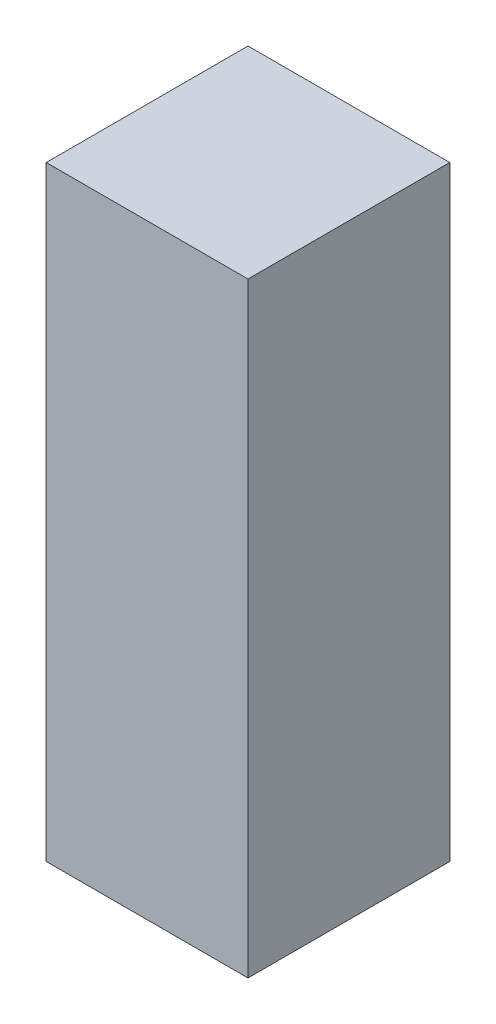
ISO-10303-21;
HEADER;
FILE_DESCRIPTION(('STEP AP214'),'2;1');
FILE_NAME('part.step','',(''),(''),'','','');
FILE_SCHEMA(('AUTOMOTIVE_DESIGN { 1 0 10303 214 1 1 1 1 }'));
ENDSEC;
DATA;
#1=APPLICATION_CONTEXT('core data for automotive mechanical design processes');
#2=APPLICATION_PROTOCOL_DEFINITION('international standard','automotive_design',2000,#1);
#3=PRODUCT_CONTEXT('',#1,'mechanical');
#4=PRODUCT('Part','Part','',(#3));
#5=PRODUCT_RELATED_PRODUCT_CATEGORY('part','',(#4));
#6=PRODUCT_DEFINITION_FORMATION('','',#4);
#7=PRODUCT_DEFINITION_CONTEXT('part definition',#1,'design');
#8=PRODUCT_DEFINITION('design','',#6,#7);
#9=PRODUCT_DEFINITION_SHAPE('','',#8);
#10=(LENGTH_UNIT() NAMED_UNIT(*) SI_UNIT(.MILLI.,.METRE.));
#11=(NAMED_UNIT(*) PLANE_ANGLE_UNIT() SI_UNIT($,.RADIAN.));
#12=(NAMED_UNIT(*) SI_UNIT($,.STERADIAN.) SOLID_ANGLE_UNIT());
#13=UNCERTAINTY_MEASURE_WITH_UNIT(LENGTH_MEASURE(1.E-05),#10,'distance_accuracy_value','');
#14=(GEOMETRIC_REPRESENTATION_CONTEXT(3) GLOBAL_UNCERTAINTY_ASSIGNED_CONTEXT((#13)) GLOBAL_UNIT_ASSIGNED_CONTEXT((#10,
#11,#12)) REPRESENTATION_CONTEXT('',''));
#15=CARTESIAN_POINT('',(0.,0.,0.));
#16=DIRECTION('',(0.,0.,1.));
#17=DIRECTION('',(1.,0.,0.));
#18=AXIS2_PLACEMENT_3D('',#15,#16,#17);
#19=CARTESIAN_POINT('',(-52.7986929138008,150.,-32.2514183315828));
#20=DIRECTION('',(1.,0.,0.));
#21=DIRECTION('',(0.,0.,-1.));
#22=AXIS2_PLACEMENT_3D('',#19,#20,#21);
#23=PLANE('',#22);
#24=DIRECTION('',(0.,0.,1.));
#25=VECTOR('',#24,1.);
#26=CARTESIAN_POINT('',(-52.7986929138008,0.,-32.2514183315828));
#27=LINE('',#26,#25);
#28=CARTESIAN_POINT('',(-52.7986929138008,0.,-32.2514183315828));
#29=VERTEX_POINT('',#28);
#30=CARTESIAN_POINT('',(-52.7986929138008,0.,17.7485816684172));
#31=VERTEX_POINT('',#30);
#32=EDGE_CURVE('E96',#29,#31,#27,.T.);
#33=ORIENTED_EDGE('',*,*,#32,.T.);
#34=DIRECTION('',(0.,-1.,0.));
#35=VECTOR('',#34,1.);
#36=CARTESIAN_POINT('',(-52.7986929138008,150.,17.7485816684172));
#37=LINE('',#36,#35);
#38=CARTESIAN_POINT('',(-52.7986929138008,150.,17.7485816684172));
#39=VERTEX_POINT('',#38);
#40=EDGE_CURVE('E11',#39,#31,#37,.T.);
#41=ORIENTED_EDGE('',*,*,#40,.F.);
#42=DIRECTION('',(0.,0.,1.));
#43=VECTOR('',#42,1.);
#44=CARTESIAN_POINT('',(-52.7986929138008,150.,-32.2514183315828));
#45=LINE('',#44,#43);
#46=CARTESIAN_POINT('',(-52.7986929138008,150.,-32.2514183315828));
#47=VERTEX_POINT('',#46);
#48=EDGE_CURVE('E84',#47,#39,#45,.T.);
#49=ORIENTED_EDGE('',*,*,#48,.F.);
#50=DIRECTION('',(0.,-1.,0.));
#51=VECTOR('',#50,1.);
#52=CARTESIAN_POINT('',(-52.7986929138008,150.,-32.2514183315828));
#53=LINE('',#52,#51);
#54=EDGE_CURVE('E92',#47,#29,#53,.T.);
#55=ORIENTED_EDGE('',*,*,#54,.T.);
#56=EDGE_LOOP('',(#33,#41,#49,#55));
#57=FACE_BOUND('',#56,.T.);
#58=ADVANCED_FACE('F33',(#57),#23,.F.);
#59=CARTESIAN_POINT('',(-52.7986929138008,150.,17.7485816684172));
#60=DIRECTION('',(0.,0.,-1.));
#61=DIRECTION('',(-1.,0.,0.));
#62=AXIS2_PLACEMENT_3D('',#59,#60,#61);
#63=PLANE('',#62);
#64=DIRECTION('',(1.,0.,0.));
#65=VECTOR('',#64,1.);
#66=CARTESIAN_POINT('',(-52.7986929138008,0.,17.7485816684172));
#67=LINE('',#66,#65);
#68=CARTESIAN_POINT('',(-2.79869291380084,0.,17.7485816684172));
#69=VERTEX_POINT('',#68);
#70=EDGE_CURVE('E88',#31,#69,#67,.T.);
#71=ORIENTED_EDGE('',*,*,#70,.T.);
#72=DIRECTION('',(0.,-1.,0.));
#73=VECTOR('',#72,1.);
#74=CARTESIAN_POINT('',(-2.79869291380084,150.,17.7485816684172));
#75=LINE('',#74,#73);
#76=CARTESIAN_POINT('',(-2.79869291380084,150.,17.7485816684172));
#77=VERTEX_POINT('',#76);
#78=EDGE_CURVE('E41',#77,#69,#75,.T.);
#79=ORIENTED_EDGE('',*,*,#78,.F.);
#80=DIRECTION('',(1.,0.,0.));
#81=VECTOR('',#80,1.);
#82=CARTESIAN_POINT('',(-52.7986929138008,150.,17.7485816684172));
#83=LINE('',#82,#81);
#84=EDGE_CURVE('E79',#39,#77,#83,.T.);
#85=ORIENTED_EDGE('',*,*,#84,.F.);
#86=ORIENTED_EDGE('',*,*,#40,.T.);
#87=EDGE_LOOP('',(#71,#79,#85,#86));
#88=FACE_BOUND('',#87,.T.);
#89=ADVANCED_FACE('F87',(#88),#63,.F.);
#90=CARTESIAN_POINT('',(-2.79869291380085,150.,-32.2514183315828));
#91=DIRECTION('',(-1.,0.,0.));
#92=DIRECTION('',(0.,0.,1.));
#93=AXIS2_PLACEMENT_3D('',#90,#91,#92);
#94=PLANE('',#93);
#95=DIRECTION('',(0.,0.,-1.));
#96=VECTOR('',#95,1.);
#97=CARTESIAN_POINT('',(-2.79869291380085,0.,-32.2514183315828));
#98=LINE('',#97,#96);
#99=CARTESIAN_POINT('',(-2.79869291380085,0.,-32.2514183315828));
#100=VERTEX_POINT('',#99);
#101=EDGE_CURVE('E66',#69,#100,#98,.T.);
#102=ORIENTED_EDGE('',*,*,#101,.T.);
#103=DIRECTION('',(0.,-1.,0.));
#104=VECTOR('',#103,1.);
#105=CARTESIAN_POINT('',(-2.79869291380085,150.,-32.2514183315828));
#106=LINE('',#105,#104);
#107=CARTESIAN_POINT('',(-2.79869291380085,150.,-32.2514183315828));
#108=VERTEX_POINT('',#107);
#109=EDGE_CURVE('E89',#108,#100,#106,.T.);
#110=ORIENTED_EDGE('',*,*,#109,.F.);
#111=DIRECTION('',(0.,0.,-1.));
#112=VECTOR('',#111,1.);
#113=CARTESIAN_POINT('',(-2.79869291380085,150.,-32.2514183315828));
#114=LINE('',#113,#112);
#115=EDGE_CURVE('E82',#77,#108,#114,.T.);
#116=ORIENTED_EDGE('',*,*,#115,.F.);
#117=ORIENTED_EDGE('',*,*,#78,.T.);
#118=EDGE_LOOP('',(#102,#110,#116,#117));
#119=FACE_BOUND('',#118,.T.);
#120=ADVANCED_FACE('F90',(#119),#94,.F.);
#121=CARTESIAN_POINT('',(-52.7986929138008,150.,-32.2514183315828));
#122=DIRECTION('',(0.,0.,1.));
#123=DIRECTION('',(1.,0.,0.));
#124=AXIS2_PLACEMENT_3D('',#121,#122,#123);
#125=PLANE('',#124);
#126=DIRECTION('',(-1.,0.,0.));
#127=VECTOR('',#126,1.);
#128=CARTESIAN_POINT('',(-52.7986929138008,0.,-32.2514183315828));
#129=LINE('',#128,#127);
#130=EDGE_CURVE('E72',#100,#29,#129,.T.);
#131=ORIENTED_EDGE('',*,*,#130,.T.);
#132=ORIENTED_EDGE('',*,*,#54,.F.);
#133=DIRECTION('',(-1.,0.,0.));
#134=VECTOR('',#133,1.);
#135=CARTESIAN_POINT('',(-52.7986929138008,150.,-32.2514183315828));
#136=LINE('',#135,#134);
#137=EDGE_CURVE('E49',#108,#47,#136,.T.);
#138=ORIENTED_EDGE('',*,*,#137,.F.);
#139=ORIENTED_EDGE('',*,*,#109,.T.);
#140=EDGE_LOOP('',(#131,#132,#138,#139));
#141=FACE_BOUND('',#140,.T.);
#142=ADVANCED_FACE('F104',(#141),#125,.F.);
#143=CARTESIAN_POINT('',(0.,150.,0.));
#144=DIRECTION('',(0.,1.,0.));
#145=DIRECTION('',(0.,0.,1.));
#146=AXIS2_PLACEMENT_3D('',#143,#144,#145);
#147=PLANE('',#146);
#148=ORIENTED_EDGE('',*,*,#48,.T.);
#149=ORIENTED_EDGE('',*,*,#84,.T.);
#150=ORIENTED_EDGE('',*,*,#115,.T.);
#151=ORIENTED_EDGE('',*,*,#137,.T.);
#152=EDGE_LOOP('',(#148,#149,#150,#151));
#153=FACE_BOUND('',#152,.T.);
#154=ADVANCED_FACE('F80',(#153),#147,.T.);
#155=CARTESIAN_POINT('',(0.,0.,0.));
#156=DIRECTION('',(0.,1.,0.));
#157=DIRECTION('',(0.,0.,1.));
#158=AXIS2_PLACEMENT_3D('',#155,#156,#157);
#159=PLANE('',#158);
#160=CARTESIAN_POINT('',(-27.7986929138008,0.,-7.25141833158278));
#161=DIRECTION('',(0.,-1.,0.));
#162=DIRECTION('',(0.,0.,-1.));
#163=AXIS2_PLACEMENT_3D('',#160,#161,#162);
#164=CIRCLE('',#163,15.);
#165=CARTESIAN_POINT('',(-27.7986929138008,0.,-22.2514183315828));
#166=VERTEX_POINT('',#165);
#167=EDGE_CURVE('E110',#166,#166,#164,.T.);
#168=ORIENTED_EDGE('',*,*,#167,.F.);
#169=EDGE_LOOP('',(#168));
#170=FACE_BOUND('',#169,.T.);
#171=ORIENTED_EDGE('',*,*,#32,.F.);
#172=ORIENTED_EDGE('',*,*,#130,.F.);
#173=ORIENTED_EDGE('',*,*,#101,.F.);
#174=ORIENTED_EDGE('',*,*,#70,.F.);
#175=EDGE_LOOP('',(#171,#172,#173,#174));
#176=FACE_BOUND('',#175,.T.);
#177=ADVANCED_FACE('F107',(#170,#176),#159,.F.);
#178=CARTESIAN_POINT('',(-27.7986929138008,100.,-7.25141833158278));
#179=DIRECTION('',(0.,-1.,0.));
#180=DIRECTION('',(0.,0.,-1.));
#181=AXIS2_PLACEMENT_3D('',#178,#179,#180);
#182=CYLINDRICAL_SURFACE('',#181,15.);
#183=CARTESIAN_POINT('',(-27.7986929138008,100.,-7.25141833158278));
#184=DIRECTION('',(0.,-1.,0.));
#185=DIRECTION('',(0.,0.,-1.));
#186=AXIS2_PLACEMENT_3D('',#183,#184,#185);
#187=CIRCLE('',#186,15.);
#188=CARTESIAN_POINT('',(-27.7986929138008,100.,-22.2514183315828));
#189=VERTEX_POINT('',#188);
#190=EDGE_CURVE('E99',#189,#189,#187,.T.);
#191=ORIENTED_EDGE('',*,*,#190,.F.);
#192=EDGE_LOOP('',(#191));
#193=FACE_BOUND('',#192,.T.);
#194=ORIENTED_EDGE('',*,*,#167,.T.);
#195=EDGE_LOOP('',(#194));
#196=FACE_BOUND('',#195,.T.);
#197=ADVANCED_FACE('F118',(#193,#196),#182,.F.);
#198=CARTESIAN_POINT('',(-27.7986929138008,100.,-7.25141833158278));
#199=DIRECTION('',(0.,-1.,0.));
#200=DIRECTION('',(0.,0.,-1.));
#201=AXIS2_PLACEMENT_3D('',#198,#199,#200);
#202=PLANE('',#201);
#203=ORIENTED_EDGE('',*,*,#190,.T.);
#204=EDGE_LOOP('',(#203));
#205=FACE_BOUND('',#204,.T.);
#206=ADVANCED_FACE('F116',(#205),#202,.T.);
#207=CLOSED_SHELL('',(#58,#89,#120,#142,#154,#177,#197,#206));
#208=MANIFOLD_SOLID_BREP('B2',#207);
#209=ADVANCED_BREP_SHAPE_REPRESENTATION('',(#18,#208),#14);
#210=SHAPE_DEFINITION_REPRESENTATION(#9,#209);
ENDSEC;
END-ISO-10303-21;
